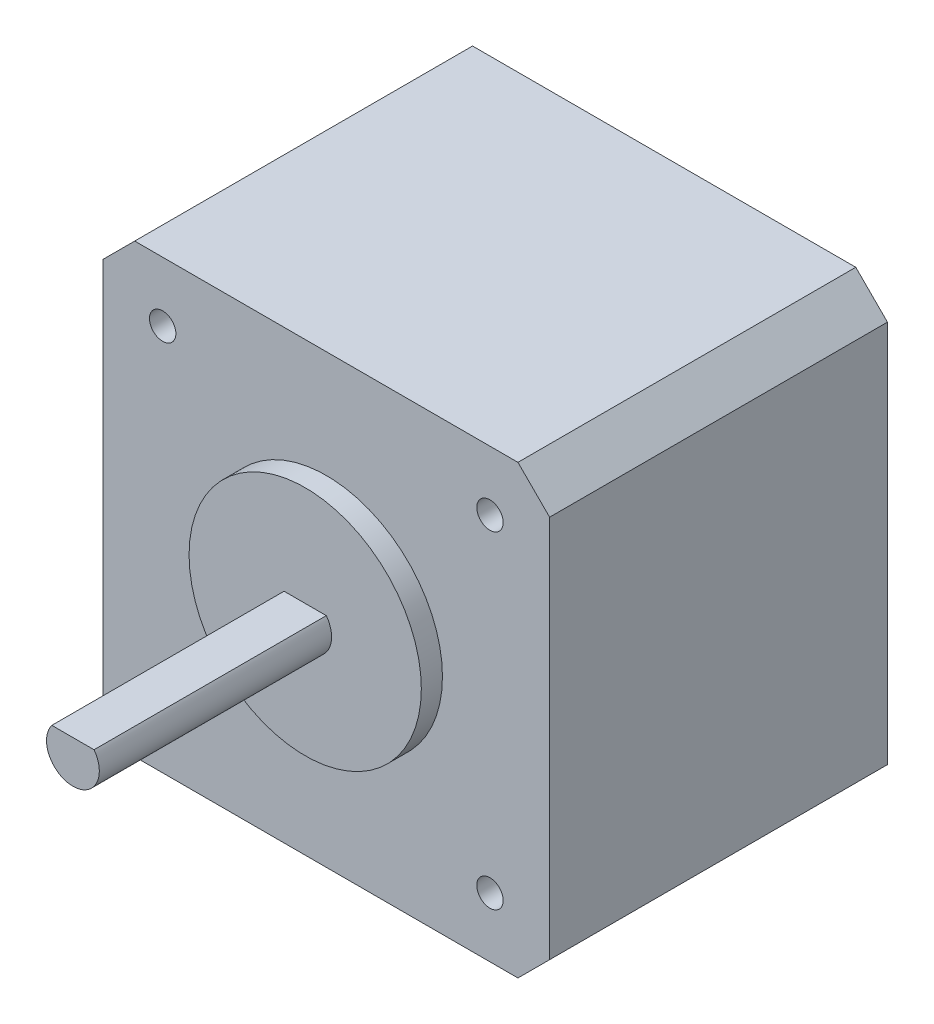
ISO-10303-21;
HEADER;
FILE_DESCRIPTION(('STEP AP214'),'2;1');
FILE_NAME('part.step','',(''),(''),'','','');
FILE_SCHEMA(('AUTOMOTIVE_DESIGN { 1 0 10303 214 1 1 1 1 }'));
ENDSEC;
DATA;
#1=APPLICATION_CONTEXT('core data for automotive mechanical design processes');
#2=APPLICATION_PROTOCOL_DEFINITION('international standard','automotive_design',2000,#1);
#3=PRODUCT_CONTEXT('',#1,'mechanical');
#4=PRODUCT('Part','Part','',(#3));
#5=PRODUCT_RELATED_PRODUCT_CATEGORY('part','',(#4));
#6=PRODUCT_DEFINITION_FORMATION('','',#4);
#7=PRODUCT_DEFINITION_CONTEXT('part definition',#1,'design');
#8=PRODUCT_DEFINITION('design','',#6,#7);
#9=PRODUCT_DEFINITION_SHAPE('','',#8);
#10=(LENGTH_UNIT() NAMED_UNIT(*) SI_UNIT(.MILLI.,.METRE.));
#11=(NAMED_UNIT(*) PLANE_ANGLE_UNIT() SI_UNIT($,.RADIAN.));
#12=(NAMED_UNIT(*) SI_UNIT($,.STERADIAN.) SOLID_ANGLE_UNIT());
#13=UNCERTAINTY_MEASURE_WITH_UNIT(LENGTH_MEASURE(1.E-05),#10,'distance_accuracy_value','');
#14=(GEOMETRIC_REPRESENTATION_CONTEXT(3) GLOBAL_UNCERTAINTY_ASSIGNED_CONTEXT((#13)) GLOBAL_UNIT_ASSIGNED_CONTEXT((#10,
#11,#12)) REPRESENTATION_CONTEXT('',''));
#15=CARTESIAN_POINT('',(0.,0.,0.));
#16=DIRECTION('',(0.,0.,1.));
#17=DIRECTION('',(1.,0.,0.));
#18=AXIS2_PLACEMENT_3D('',#15,#16,#17);
#19=CARTESIAN_POINT('',(18.15,21.15,32.));
#20=DIRECTION('',(0.,-1.,0.));
#21=DIRECTION('',(1.,0.,0.));
#22=AXIS2_PLACEMENT_3D('',#19,#20,#21);
#23=PLANE('',#22);
#24=DIRECTION('',(-1.,0.,0.));
#25=VECTOR('',#24,1.);
#26=CARTESIAN_POINT('',(18.15,21.15,0.));
#27=LINE('',#26,#25);
#28=CARTESIAN_POINT('',(18.15,21.15,0.));
#29=VERTEX_POINT('',#28);
#30=CARTESIAN_POINT('',(-18.15,21.15,0.));
#31=VERTEX_POINT('',#30);
#32=EDGE_CURVE('E142',#29,#31,#27,.T.);
#33=ORIENTED_EDGE('',*,*,#32,.T.);
#34=DIRECTION('',(0.,0.,-1.));
#35=VECTOR('',#34,1.);
#36=CARTESIAN_POINT('',(-18.15,21.15,32.));
#37=LINE('',#36,#35);
#38=CARTESIAN_POINT('',(-18.15,21.15,32.));
#39=VERTEX_POINT('',#38);
#40=EDGE_CURVE('E36',#39,#31,#37,.T.);
#41=ORIENTED_EDGE('',*,*,#40,.F.);
#42=DIRECTION('',(-1.,0.,0.));
#43=VECTOR('',#42,1.);
#44=CARTESIAN_POINT('',(18.15,21.15,32.));
#45=LINE('',#44,#43);
#46=CARTESIAN_POINT('',(18.15,21.15,32.));
#47=VERTEX_POINT('',#46);
#48=EDGE_CURVE('E158',#47,#39,#45,.T.);
#49=ORIENTED_EDGE('',*,*,#48,.F.);
#50=DIRECTION('',(0.,0.,-1.));
#51=VECTOR('',#50,1.);
#52=CARTESIAN_POINT('',(18.15,21.15,32.));
#53=LINE('',#52,#51);
#54=EDGE_CURVE('E138',#47,#29,#53,.T.);
#55=ORIENTED_EDGE('',*,*,#54,.T.);
#56=EDGE_LOOP('',(#33,#41,#49,#55));
#57=FACE_BOUND('',#56,.T.);
#58=ADVANCED_FACE('F33',(#57),#23,.F.);
#59=CARTESIAN_POINT('',(-18.15,21.15,32.));
#60=DIRECTION('',(0.707106781186547,-0.707106781186547,0.));
#61=DIRECTION('',(0.707106781186548,0.707106781186548,0.));
#62=AXIS2_PLACEMENT_3D('',#59,#60,#61);
#63=PLANE('',#62);
#64=DIRECTION('',(-0.707106781186548,-0.707106781186548,0.));
#65=VECTOR('',#64,1.);
#66=CARTESIAN_POINT('',(-18.15,21.15,0.));
#67=LINE('',#66,#65);
#68=CARTESIAN_POINT('',(-21.15,18.15,0.));
#69=VERTEX_POINT('',#68);
#70=EDGE_CURVE('E145',#31,#69,#67,.T.);
#71=ORIENTED_EDGE('',*,*,#70,.T.);
#72=DIRECTION('',(0.,0.,-1.));
#73=VECTOR('',#72,1.);
#74=CARTESIAN_POINT('',(-21.15,18.15,32.));
#75=LINE('',#74,#73);
#76=CARTESIAN_POINT('',(-21.15,18.15,32.));
#77=VERTEX_POINT('',#76);
#78=EDGE_CURVE('E167',#77,#69,#75,.T.);
#79=ORIENTED_EDGE('',*,*,#78,.F.);
#80=DIRECTION('',(-0.707106781186548,-0.707106781186548,0.));
#81=VECTOR('',#80,1.);
#82=CARTESIAN_POINT('',(-18.15,21.15,32.));
#83=LINE('',#82,#81);
#84=EDGE_CURVE('E98',#39,#77,#83,.T.);
#85=ORIENTED_EDGE('',*,*,#84,.F.);
#86=ORIENTED_EDGE('',*,*,#40,.T.);
#87=EDGE_LOOP('',(#71,#79,#85,#86));
#88=FACE_BOUND('',#87,.T.);
#89=ADVANCED_FACE('F173',(#88),#63,.F.);
#90=CARTESIAN_POINT('',(-21.15,18.15,32.));
#91=DIRECTION('',(1.,0.,0.));
#92=DIRECTION('',(0.,1.,0.));
#93=AXIS2_PLACEMENT_3D('',#90,#91,#92);
#94=PLANE('',#93);
#95=DIRECTION('',(0.,-1.,0.));
#96=VECTOR('',#95,1.);
#97=CARTESIAN_POINT('',(-21.15,18.15,0.));
#98=LINE('',#97,#96);
#99=CARTESIAN_POINT('',(-21.15,-18.15,0.));
#100=VERTEX_POINT('',#99);
#101=EDGE_CURVE('E148',#69,#100,#98,.T.);
#102=ORIENTED_EDGE('',*,*,#101,.T.);
#103=DIRECTION('',(0.,0.,-1.));
#104=VECTOR('',#103,1.);
#105=CARTESIAN_POINT('',(-21.15,-18.15,32.));
#106=LINE('',#105,#104);
#107=CARTESIAN_POINT('',(-21.15,-18.15,32.));
#108=VERTEX_POINT('',#107);
#109=EDGE_CURVE('E165',#108,#100,#106,.T.);
#110=ORIENTED_EDGE('',*,*,#109,.F.);
#111=DIRECTION('',(0.,-1.,0.));
#112=VECTOR('',#111,1.);
#113=CARTESIAN_POINT('',(-21.15,18.15,32.));
#114=LINE('',#113,#112);
#115=EDGE_CURVE('E188',#77,#108,#114,.T.);
#116=ORIENTED_EDGE('',*,*,#115,.F.);
#117=ORIENTED_EDGE('',*,*,#78,.T.);
#118=EDGE_LOOP('',(#102,#110,#116,#117));
#119=FACE_BOUND('',#118,.T.);
#120=ADVANCED_FACE('F182',(#119),#94,.F.);
#121=CARTESIAN_POINT('',(-18.15,-21.15,32.));
#122=DIRECTION('',(0.707106781186547,0.707106781186547,0.));
#123=DIRECTION('',(-0.707106781186548,0.707106781186548,0.));
#124=AXIS2_PLACEMENT_3D('',#121,#122,#123);
#125=PLANE('',#124);
#126=DIRECTION('',(0.707106781186548,-0.707106781186548,0.));
#127=VECTOR('',#126,1.);
#128=CARTESIAN_POINT('',(-18.15,-21.15,0.));
#129=LINE('',#128,#127);
#130=CARTESIAN_POINT('',(-18.15,-21.15,0.));
#131=VERTEX_POINT('',#130);
#132=EDGE_CURVE('E150',#100,#131,#129,.T.);
#133=ORIENTED_EDGE('',*,*,#132,.T.);
#134=DIRECTION('',(0.,0.,-1.));
#135=VECTOR('',#134,1.);
#136=CARTESIAN_POINT('',(-18.15,-21.15,32.));
#137=LINE('',#136,#135);
#138=CARTESIAN_POINT('',(-18.15,-21.15,32.));
#139=VERTEX_POINT('',#138);
#140=EDGE_CURVE('E162',#139,#131,#137,.T.);
#141=ORIENTED_EDGE('',*,*,#140,.F.);
#142=DIRECTION('',(0.707106781186548,-0.707106781186548,0.));
#143=VECTOR('',#142,1.);
#144=CARTESIAN_POINT('',(-18.15,-21.15,32.));
#145=LINE('',#144,#143);
#146=EDGE_CURVE('E187',#108,#139,#145,.T.);
#147=ORIENTED_EDGE('',*,*,#146,.F.);
#148=ORIENTED_EDGE('',*,*,#109,.T.);
#149=EDGE_LOOP('',(#133,#141,#147,#148));
#150=FACE_BOUND('',#149,.T.);
#151=ADVANCED_FACE('F185',(#150),#125,.F.);
#152=CARTESIAN_POINT('',(18.15,-21.15,32.));
#153=DIRECTION('',(0.,1.,0.));
#154=DIRECTION('',(0.,0.,1.));
#155=AXIS2_PLACEMENT_3D('',#152,#153,#154);
#156=PLANE('',#155);
#157=DIRECTION('',(1.,0.,0.));
#158=VECTOR('',#157,1.);
#159=CARTESIAN_POINT('',(18.15,-21.15,0.));
#160=LINE('',#159,#158);
#161=CARTESIAN_POINT('',(18.15,-21.15,0.));
#162=VERTEX_POINT('',#161);
#163=EDGE_CURVE('E152',#131,#162,#160,.T.);
#164=ORIENTED_EDGE('',*,*,#163,.T.);
#165=DIRECTION('',(0.,0.,-1.));
#166=VECTOR('',#165,1.);
#167=CARTESIAN_POINT('',(18.15,-21.15,32.));
#168=LINE('',#167,#166);
#169=CARTESIAN_POINT('',(18.15,-21.15,32.));
#170=VERTEX_POINT('',#169);
#171=EDGE_CURVE('E133',#170,#162,#168,.T.);
#172=ORIENTED_EDGE('',*,*,#171,.F.);
#173=DIRECTION('',(1.,0.,0.));
#174=VECTOR('',#173,1.);
#175=CARTESIAN_POINT('',(18.15,-21.15,32.));
#176=LINE('',#175,#174);
#177=EDGE_CURVE('E121',#139,#170,#176,.T.);
#178=ORIENTED_EDGE('',*,*,#177,.F.);
#179=ORIENTED_EDGE('',*,*,#140,.T.);
#180=EDGE_LOOP('',(#164,#172,#178,#179));
#181=FACE_BOUND('',#180,.T.);
#182=ADVANCED_FACE('F278',(#181),#156,.F.);
#183=CARTESIAN_POINT('',(21.15,-18.15,32.));
#184=DIRECTION('',(-0.707106781186548,0.707106781186547,0.));
#185=DIRECTION('',(-0.707106781186547,-0.707106781186548,0.));
#186=AXIS2_PLACEMENT_3D('',#183,#184,#185);
#187=PLANE('',#186);
#188=DIRECTION('',(0.707106781186547,0.707106781186548,0.));
#189=VECTOR('',#188,1.);
#190=CARTESIAN_POINT('',(21.15,-18.15,0.));
#191=LINE('',#190,#189);
#192=CARTESIAN_POINT('',(21.15,-18.15,0.));
#193=VERTEX_POINT('',#192);
#194=EDGE_CURVE('E130',#162,#193,#191,.T.);
#195=ORIENTED_EDGE('',*,*,#194,.T.);
#196=DIRECTION('',(0.,0.,-1.));
#197=VECTOR('',#196,1.);
#198=CARTESIAN_POINT('',(21.15,-18.15,32.));
#199=LINE('',#198,#197);
#200=CARTESIAN_POINT('',(21.15,-18.15,32.));
#201=VERTEX_POINT('',#200);
#202=EDGE_CURVE('E127',#201,#193,#199,.T.);
#203=ORIENTED_EDGE('',*,*,#202,.F.);
#204=DIRECTION('',(0.707106781186547,0.707106781186548,0.));
#205=VECTOR('',#204,1.);
#206=CARTESIAN_POINT('',(21.15,-18.15,32.));
#207=LINE('',#206,#205);
#208=EDGE_CURVE('E114',#170,#201,#207,.T.);
#209=ORIENTED_EDGE('',*,*,#208,.F.);
#210=ORIENTED_EDGE('',*,*,#171,.T.);
#211=EDGE_LOOP('',(#195,#203,#209,#210));
#212=FACE_BOUND('',#211,.T.);
#213=ADVANCED_FACE('F128',(#212),#187,.F.);
#214=CARTESIAN_POINT('',(21.15,18.15,32.));
#215=DIRECTION('',(-1.,0.,0.));
#216=DIRECTION('',(0.,-1.,0.));
#217=AXIS2_PLACEMENT_3D('',#214,#215,#216);
#218=PLANE('',#217);
#219=DIRECTION('',(0.,1.,0.));
#220=VECTOR('',#219,1.);
#221=CARTESIAN_POINT('',(21.15,18.15,0.));
#222=LINE('',#221,#220);
#223=CARTESIAN_POINT('',(21.15,18.15,0.));
#224=VERTEX_POINT('',#223);
#225=EDGE_CURVE('E155',#193,#224,#222,.T.);
#226=ORIENTED_EDGE('',*,*,#225,.T.);
#227=DIRECTION('',(0.,0.,-1.));
#228=VECTOR('',#227,1.);
#229=CARTESIAN_POINT('',(21.15,18.15,32.));
#230=LINE('',#229,#228);
#231=CARTESIAN_POINT('',(21.15,18.15,32.));
#232=VERTEX_POINT('',#231);
#233=EDGE_CURVE('E134',#232,#224,#230,.T.);
#234=ORIENTED_EDGE('',*,*,#233,.F.);
#235=DIRECTION('',(0.,1.,0.));
#236=VECTOR('',#235,1.);
#237=CARTESIAN_POINT('',(21.15,18.15,32.));
#238=LINE('',#237,#236);
#239=EDGE_CURVE('E118',#201,#232,#238,.T.);
#240=ORIENTED_EDGE('',*,*,#239,.F.);
#241=ORIENTED_EDGE('',*,*,#202,.T.);
#242=EDGE_LOOP('',(#226,#234,#240,#241));
#243=FACE_BOUND('',#242,.T.);
#244=ADVANCED_FACE('F136',(#243),#218,.F.);
#245=CARTESIAN_POINT('',(21.15,18.15,32.));
#246=DIRECTION('',(-0.707106781186547,-0.707106781186547,0.));
#247=DIRECTION('',(0.707106781186548,-0.707106781186548,0.));
#248=AXIS2_PLACEMENT_3D('',#245,#246,#247);
#249=PLANE('',#248);
#250=DIRECTION('',(-0.707106781186548,0.707106781186548,0.));
#251=VECTOR('',#250,1.);
#252=CARTESIAN_POINT('',(21.15,18.15,0.));
#253=LINE('',#252,#251);
#254=EDGE_CURVE('E89',#224,#29,#253,.T.);
#255=ORIENTED_EDGE('',*,*,#254,.T.);
#256=ORIENTED_EDGE('',*,*,#54,.F.);
#257=DIRECTION('',(-0.707106781186548,0.707106781186548,0.));
#258=VECTOR('',#257,1.);
#259=CARTESIAN_POINT('',(21.15,18.15,32.));
#260=LINE('',#259,#258);
#261=EDGE_CURVE('E56',#232,#47,#260,.T.);
#262=ORIENTED_EDGE('',*,*,#261,.F.);
#263=ORIENTED_EDGE('',*,*,#233,.T.);
#264=EDGE_LOOP('',(#255,#256,#262,#263));
#265=FACE_BOUND('',#264,.T.);
#266=ADVANCED_FACE('F247',(#265),#249,.F.);
#267=CARTESIAN_POINT('',(0.,0.,32.));
#268=DIRECTION('',(0.,0.,1.));
#269=DIRECTION('',(1.,0.,0.));
#270=AXIS2_PLACEMENT_3D('',#267,#268,#269);
#271=PLANE('',#270);
#272=CARTESIAN_POINT('',(-15.5,-15.5,32.));
#273=DIRECTION('',(0.,0.,1.));
#274=DIRECTION('',(1.,0.,0.));
#275=AXIS2_PLACEMENT_3D('',#272,#273,#274);
#276=CIRCLE('',#275,1.25);
#277=CARTESIAN_POINT('',(-14.25,-15.5,32.));
#278=VERTEX_POINT('',#277);
#279=EDGE_CURVE('E218',#278,#278,#276,.T.);
#280=ORIENTED_EDGE('',*,*,#279,.F.);
#281=EDGE_LOOP('',(#280));
#282=FACE_BOUND('',#281,.T.);
#283=CARTESIAN_POINT('',(15.5,-15.5,32.));
#284=DIRECTION('',(0.,0.,1.));
#285=DIRECTION('',(1.,0.,0.));
#286=AXIS2_PLACEMENT_3D('',#283,#284,#285);
#287=CIRCLE('',#286,1.25);
#288=CARTESIAN_POINT('',(16.75,-15.5,32.));
#289=VERTEX_POINT('',#288);
#290=EDGE_CURVE('E224',#289,#289,#287,.T.);
#291=ORIENTED_EDGE('',*,*,#290,.F.);
#292=EDGE_LOOP('',(#291));
#293=FACE_BOUND('',#292,.T.);
#294=CARTESIAN_POINT('',(15.5,15.5,32.));
#295=DIRECTION('',(0.,0.,1.));
#296=DIRECTION('',(1.,0.,0.));
#297=AXIS2_PLACEMENT_3D('',#294,#295,#296);
#298=CIRCLE('',#297,1.25);
#299=CARTESIAN_POINT('',(16.75,15.5,32.));
#300=VERTEX_POINT('',#299);
#301=EDGE_CURVE('E230',#300,#300,#298,.T.);
#302=ORIENTED_EDGE('',*,*,#301,.F.);
#303=EDGE_LOOP('',(#302));
#304=FACE_BOUND('',#303,.T.);
#305=CARTESIAN_POINT('',(-15.5,15.5,32.));
#306=DIRECTION('',(0.,0.,1.));
#307=DIRECTION('',(1.,0.,0.));
#308=AXIS2_PLACEMENT_3D('',#305,#306,#307);
#309=CIRCLE('',#308,1.25);
#310=CARTESIAN_POINT('',(-14.25,15.5,32.));
#311=VERTEX_POINT('',#310);
#312=EDGE_CURVE('E212',#311,#311,#309,.T.);
#313=ORIENTED_EDGE('',*,*,#312,.F.);
#314=EDGE_LOOP('',(#313));
#315=FACE_BOUND('',#314,.T.);
#316=CARTESIAN_POINT('',(0.,0.,32.));
#317=DIRECTION('',(0.,0.,1.));
#318=DIRECTION('',(1.,0.,0.));
#319=AXIS2_PLACEMENT_3D('',#316,#317,#318);
#320=CIRCLE('',#319,11.);
#321=CARTESIAN_POINT('',(11.,0.,32.));
#322=VERTEX_POINT('',#321);
#323=EDGE_CURVE('E11',#322,#322,#320,.T.);
#324=ORIENTED_EDGE('',*,*,#323,.F.);
#325=EDGE_LOOP('',(#324));
#326=FACE_BOUND('',#325,.T.);
#327=ORIENTED_EDGE('',*,*,#48,.T.);
#328=ORIENTED_EDGE('',*,*,#84,.T.);
#329=ORIENTED_EDGE('',*,*,#115,.T.);
#330=ORIENTED_EDGE('',*,*,#146,.T.);
#331=ORIENTED_EDGE('',*,*,#177,.T.);
#332=ORIENTED_EDGE('',*,*,#208,.T.);
#333=ORIENTED_EDGE('',*,*,#239,.T.);
#334=ORIENTED_EDGE('',*,*,#261,.T.);
#335=EDGE_LOOP('',(#327,#328,#329,#330,#331,#332,#333,#334));
#336=FACE_BOUND('',#335,.T.);
#337=ADVANCED_FACE('F116',(#282,#293,#304,#315,#326,#336),#271,.T.);
#338=CARTESIAN_POINT('',(0.,0.,0.));
#339=DIRECTION('',(0.,0.,1.));
#340=DIRECTION('',(1.,0.,0.));
#341=AXIS2_PLACEMENT_3D('',#338,#339,#340);
#342=PLANE('',#341);
#343=ORIENTED_EDGE('',*,*,#32,.F.);
#344=ORIENTED_EDGE('',*,*,#254,.F.);
#345=ORIENTED_EDGE('',*,*,#225,.F.);
#346=ORIENTED_EDGE('',*,*,#194,.F.);
#347=ORIENTED_EDGE('',*,*,#163,.F.);
#348=ORIENTED_EDGE('',*,*,#132,.F.);
#349=ORIENTED_EDGE('',*,*,#101,.F.);
#350=ORIENTED_EDGE('',*,*,#70,.F.);
#351=EDGE_LOOP('',(#343,#344,#345,#346,#347,#348,#349,#350));
#352=FACE_BOUND('',#351,.T.);
#353=ADVANCED_FACE('F178',(#352),#342,.F.);
#354=CARTESIAN_POINT('',(0.,0.,34.));
#355=DIRECTION('',(0.,0.,-1.));
#356=DIRECTION('',(-1.,0.,0.));
#357=AXIS2_PLACEMENT_3D('',#354,#355,#356);
#358=CYLINDRICAL_SURFACE('',#357,11.);
#359=CARTESIAN_POINT('',(0.,0.,34.));
#360=DIRECTION('',(0.,0.,1.));
#361=DIRECTION('',(1.,0.,0.));
#362=AXIS2_PLACEMENT_3D('',#359,#360,#361);
#363=CIRCLE('',#362,11.);
#364=CARTESIAN_POINT('',(11.,0.,34.));
#365=VERTEX_POINT('',#364);
#366=EDGE_CURVE('E146',#365,#365,#363,.T.);
#367=ORIENTED_EDGE('',*,*,#366,.F.);
#368=EDGE_LOOP('',(#367));
#369=FACE_BOUND('',#368,.T.);
#370=ORIENTED_EDGE('',*,*,#323,.T.);
#371=EDGE_LOOP('',(#370));
#372=FACE_BOUND('',#371,.T.);
#373=ADVANCED_FACE('F254',(#369,#372),#358,.T.);
#374=CARTESIAN_POINT('',(0.,0.,34.));
#375=DIRECTION('',(0.,0.,1.));
#376=DIRECTION('',(1.,0.,0.));
#377=AXIS2_PLACEMENT_3D('',#374,#375,#376);
#378=PLANE('',#377);
#379=CARTESIAN_POINT('',(0.,0.,34.));
#380=DIRECTION('',(0.,0.,1.));
#381=DIRECTION('',(1.,0.,0.));
#382=AXIS2_PLACEMENT_3D('',#379,#380,#381);
#383=CIRCLE('',#382,2.5);
#384=CARTESIAN_POINT('',(-2.,1.5,34.));
#385=VERTEX_POINT('',#384);
#386=CARTESIAN_POINT('',(2.,1.5,34.));
#387=VERTEX_POINT('',#386);
#388=EDGE_CURVE('E204',#385,#387,#383,.T.);
#389=ORIENTED_EDGE('',*,*,#388,.F.);
#390=DIRECTION('',(-1.,0.,0.));
#391=VECTOR('',#390,1.);
#392=CARTESIAN_POINT('',(-2.,1.5,34.));
#393=LINE('',#392,#391);
#394=EDGE_CURVE('E47',#387,#385,#393,.T.);
#395=ORIENTED_EDGE('',*,*,#394,.F.);
#396=EDGE_LOOP('',(#389,#395));
#397=FACE_BOUND('',#396,.T.);
#398=ORIENTED_EDGE('',*,*,#366,.T.);
#399=EDGE_LOOP('',(#398));
#400=FACE_BOUND('',#399,.T.);
#401=ADVANCED_FACE('F256',(#397,#400),#378,.T.);
#402=CARTESIAN_POINT('',(0.,0.,56.));
#403=DIRECTION('',(0.,0.,-1.));
#404=DIRECTION('',(-1.,0.,0.));
#405=AXIS2_PLACEMENT_3D('',#402,#403,#404);
#406=CYLINDRICAL_SURFACE('',#405,2.5);
#407=ORIENTED_EDGE('',*,*,#388,.T.);
#408=DIRECTION('',(0.,0.,-1.));
#409=VECTOR('',#408,1.);
#410=CARTESIAN_POINT('',(2.,1.5,56.));
#411=LINE('',#410,#409);
#412=CARTESIAN_POINT('',(2.,1.5,56.));
#413=VERTEX_POINT('',#412);
#414=EDGE_CURVE('E196',#413,#387,#411,.T.);
#415=ORIENTED_EDGE('',*,*,#414,.F.);
#416=CARTESIAN_POINT('',(0.,0.,56.));
#417=DIRECTION('',(0.,0.,1.));
#418=DIRECTION('',(1.,0.,0.));
#419=AXIS2_PLACEMENT_3D('',#416,#417,#418);
#420=CIRCLE('',#419,2.5);
#421=CARTESIAN_POINT('',(-2.,1.5,56.));
#422=VERTEX_POINT('',#421);
#423=EDGE_CURVE('E203',#422,#413,#420,.T.);
#424=ORIENTED_EDGE('',*,*,#423,.F.);
#425=DIRECTION('',(0.,0.,-1.));
#426=VECTOR('',#425,1.);
#427=CARTESIAN_POINT('',(-2.,1.5,56.));
#428=LINE('',#427,#426);
#429=EDGE_CURVE('E198',#422,#385,#428,.T.);
#430=ORIENTED_EDGE('',*,*,#429,.T.);
#431=EDGE_LOOP('',(#407,#415,#424,#430));
#432=FACE_BOUND('',#431,.T.);
#433=ADVANCED_FACE('F263',(#432),#406,.T.);
#434=CARTESIAN_POINT('',(-2.,1.5,56.));
#435=DIRECTION('',(0.,-1.,0.));
#436=DIRECTION('',(0.,0.,-1.));
#437=AXIS2_PLACEMENT_3D('',#434,#435,#436);
#438=PLANE('',#437);
#439=ORIENTED_EDGE('',*,*,#394,.T.);
#440=ORIENTED_EDGE('',*,*,#429,.F.);
#441=DIRECTION('',(-1.,0.,0.));
#442=VECTOR('',#441,1.);
#443=CARTESIAN_POINT('',(-2.,1.5,56.));
#444=LINE('',#443,#442);
#445=EDGE_CURVE('E201',#413,#422,#444,.T.);
#446=ORIENTED_EDGE('',*,*,#445,.F.);
#447=ORIENTED_EDGE('',*,*,#414,.T.);
#448=EDGE_LOOP('',(#439,#440,#446,#447));
#449=FACE_BOUND('',#448,.T.);
#450=ADVANCED_FACE('F320',(#449),#438,.F.);
#451=CARTESIAN_POINT('',(0.,0.,56.));
#452=DIRECTION('',(0.,0.,1.));
#453=DIRECTION('',(1.,0.,0.));
#454=AXIS2_PLACEMENT_3D('',#451,#452,#453);
#455=PLANE('',#454);
#456=ORIENTED_EDGE('',*,*,#423,.T.);
#457=ORIENTED_EDGE('',*,*,#445,.T.);
#458=EDGE_LOOP('',(#456,#457));
#459=FACE_BOUND('',#458,.T.);
#460=ADVANCED_FACE('F329',(#459),#455,.T.);
#461=CARTESIAN_POINT('',(-15.5,15.5,22.));
#462=DIRECTION('',(0.,0.,1.));
#463=DIRECTION('',(1.,0.,0.));
#464=AXIS2_PLACEMENT_3D('',#461,#462,#463);
#465=CYLINDRICAL_SURFACE('',#464,1.25);
#466=CARTESIAN_POINT('',(-15.5,15.5,22.));
#467=DIRECTION('',(0.,0.,1.));
#468=DIRECTION('',(1.,0.,0.));
#469=AXIS2_PLACEMENT_3D('',#466,#467,#468);
#470=CIRCLE('',#469,1.25);
#471=CARTESIAN_POINT('',(-14.25,15.5,22.));
#472=VERTEX_POINT('',#471);
#473=EDGE_CURVE('E207',#472,#472,#470,.T.);
#474=ORIENTED_EDGE('',*,*,#473,.F.);
#475=EDGE_LOOP('',(#474));
#476=FACE_BOUND('',#475,.T.);
#477=ORIENTED_EDGE('',*,*,#312,.T.);
#478=EDGE_LOOP('',(#477));
#479=FACE_BOUND('',#478,.T.);
#480=ADVANCED_FACE('F338',(#476,#479),#465,.F.);
#481=CARTESIAN_POINT('',(-15.5,15.5,22.));
#482=DIRECTION('',(0.,0.,1.));
#483=DIRECTION('',(1.,0.,0.));
#484=AXIS2_PLACEMENT_3D('',#481,#482,#483);
#485=PLANE('',#484);
#486=ORIENTED_EDGE('',*,*,#473,.T.);
#487=EDGE_LOOP('',(#486));
#488=FACE_BOUND('',#487,.T.);
#489=ADVANCED_FACE('F241',(#488),#485,.T.);
#490=CARTESIAN_POINT('',(15.5,15.5,22.));
#491=DIRECTION('',(0.,0.,1.));
#492=DIRECTION('',(1.,0.,0.));
#493=AXIS2_PLACEMENT_3D('',#490,#491,#492);
#494=CYLINDRICAL_SURFACE('',#493,1.25);
#495=CARTESIAN_POINT('',(15.5,15.5,22.));
#496=DIRECTION('',(0.,0.,1.));
#497=DIRECTION('',(1.,0.,0.));
#498=AXIS2_PLACEMENT_3D('',#495,#496,#497);
#499=CIRCLE('',#498,1.25);
#500=CARTESIAN_POINT('',(16.75,15.5,22.));
#501=VERTEX_POINT('',#500);
#502=EDGE_CURVE('E215',#501,#501,#499,.T.);
#503=ORIENTED_EDGE('',*,*,#502,.F.);
#504=EDGE_LOOP('',(#503));
#505=FACE_BOUND('',#504,.T.);
#506=ORIENTED_EDGE('',*,*,#301,.T.);
#507=EDGE_LOOP('',(#506));
#508=FACE_BOUND('',#507,.T.);
#509=ADVANCED_FACE('F238',(#505,#508),#494,.F.);
#510=CARTESIAN_POINT('',(15.5,15.5,22.));
#511=DIRECTION('',(0.,0.,1.));
#512=DIRECTION('',(1.,0.,0.));
#513=AXIS2_PLACEMENT_3D('',#510,#511,#512);
#514=PLANE('',#513);
#515=ORIENTED_EDGE('',*,*,#502,.T.);
#516=EDGE_LOOP('',(#515));
#517=FACE_BOUND('',#516,.T.);
#518=ADVANCED_FACE('F236',(#517),#514,.T.);
#519=CARTESIAN_POINT('',(15.5,-15.5,22.));
#520=DIRECTION('',(0.,0.,1.));
#521=DIRECTION('',(1.,0.,0.));
#522=AXIS2_PLACEMENT_3D('',#519,#520,#521);
#523=CYLINDRICAL_SURFACE('',#522,1.25);
#524=CARTESIAN_POINT('',(15.5,-15.5,22.));
#525=DIRECTION('',(0.,0.,1.));
#526=DIRECTION('',(1.,0.,0.));
#527=AXIS2_PLACEMENT_3D('',#524,#525,#526);
#528=CIRCLE('',#527,1.25);
#529=CARTESIAN_POINT('',(16.75,-15.5,22.));
#530=VERTEX_POINT('',#529);
#531=EDGE_CURVE('E227',#530,#530,#528,.T.);
#532=ORIENTED_EDGE('',*,*,#531,.F.);
#533=EDGE_LOOP('',(#532));
#534=FACE_BOUND('',#533,.T.);
#535=ORIENTED_EDGE('',*,*,#290,.T.);
#536=EDGE_LOOP('',(#535));
#537=FACE_BOUND('',#536,.T.);
#538=ADVANCED_FACE('F365',(#534,#537),#523,.F.);
#539=CARTESIAN_POINT('',(15.5,-15.5,22.));
#540=DIRECTION('',(0.,0.,1.));
#541=DIRECTION('',(1.,0.,0.));
#542=AXIS2_PLACEMENT_3D('',#539,#540,#541);
#543=PLANE('',#542);
#544=ORIENTED_EDGE('',*,*,#531,.T.);
#545=EDGE_LOOP('',(#544));
#546=FACE_BOUND('',#545,.T.);
#547=ADVANCED_FACE('F372',(#546),#543,.T.);
#548=CARTESIAN_POINT('',(-15.5,-15.5,22.));
#549=DIRECTION('',(0.,0.,1.));
#550=DIRECTION('',(1.,0.,0.));
#551=AXIS2_PLACEMENT_3D('',#548,#549,#550);
#552=CYLINDRICAL_SURFACE('',#551,1.25);
#553=CARTESIAN_POINT('',(-15.5,-15.5,22.));
#554=DIRECTION('',(0.,0.,1.));
#555=DIRECTION('',(1.,0.,0.));
#556=AXIS2_PLACEMENT_3D('',#553,#554,#555);
#557=CIRCLE('',#556,1.25);
#558=CARTESIAN_POINT('',(-14.25,-15.5,22.));
#559=VERTEX_POINT('',#558);
#560=EDGE_CURVE('E221',#559,#559,#557,.T.);
#561=ORIENTED_EDGE('',*,*,#560,.F.);
#562=EDGE_LOOP('',(#561));
#563=FACE_BOUND('',#562,.T.);
#564=ORIENTED_EDGE('',*,*,#279,.T.);
#565=EDGE_LOOP('',(#564));
#566=FACE_BOUND('',#565,.T.);
#567=ADVANCED_FACE('F380',(#563,#566),#552,.F.);
#568=CARTESIAN_POINT('',(-15.5,-15.5,22.));
#569=DIRECTION('',(0.,0.,1.));
#570=DIRECTION('',(1.,0.,0.));
#571=AXIS2_PLACEMENT_3D('',#568,#569,#570);
#572=PLANE('',#571);
#573=ORIENTED_EDGE('',*,*,#560,.T.);
#574=EDGE_LOOP('',(#573));
#575=FACE_BOUND('',#574,.T.);
#576=ADVANCED_FACE('F388',(#575),#572,.T.);
#577=CLOSED_SHELL('',(#58,#89,#120,#151,#182,#213,#244,#266,#337,#353,#373,#401,#433,#450,#460,
#480,#489,#509,#518,#538,#547,#567,#576));
#578=MANIFOLD_SOLID_BREP('B2',#577);
#579=ADVANCED_BREP_SHAPE_REPRESENTATION('',(#18,#578),#14);
#580=SHAPE_DEFINITION_REPRESENTATION(#9,#579);
ENDSEC;
END-ISO-10303-21;
